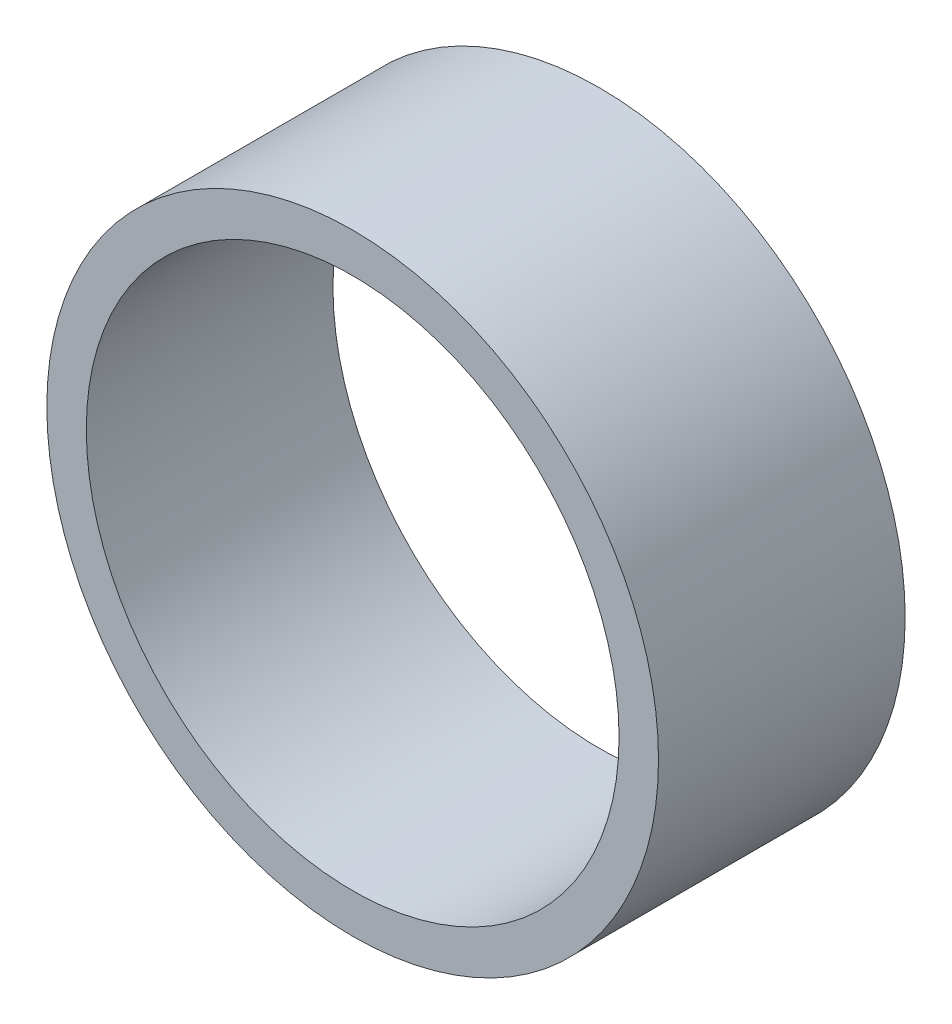
ISO-10303-21;
HEADER;
FILE_DESCRIPTION(('STEP AP214'),'2;1');
FILE_NAME('part.step','',(''),(''),'','','');
FILE_SCHEMA(('AUTOMOTIVE_DESIGN { 1 0 10303 214 1 1 1 1 }'));
ENDSEC;
DATA;
#1=APPLICATION_CONTEXT('core data for automotive mechanical design processes');
#2=APPLICATION_PROTOCOL_DEFINITION('international standard','automotive_design',2000,#1);
#3=PRODUCT_CONTEXT('',#1,'mechanical');
#4=PRODUCT('Part','Part','',(#3));
#5=PRODUCT_RELATED_PRODUCT_CATEGORY('part','',(#4));
#6=PRODUCT_DEFINITION_FORMATION('','',#4);
#7=PRODUCT_DEFINITION_CONTEXT('part definition',#1,'design');
#8=PRODUCT_DEFINITION('design','',#6,#7);
#9=PRODUCT_DEFINITION_SHAPE('','',#8);
#10=(LENGTH_UNIT() NAMED_UNIT(*) SI_UNIT(.MILLI.,.METRE.));
#11=(NAMED_UNIT(*) PLANE_ANGLE_UNIT() SI_UNIT($,.RADIAN.));
#12=(NAMED_UNIT(*) SI_UNIT($,.STERADIAN.) SOLID_ANGLE_UNIT());
#13=UNCERTAINTY_MEASURE_WITH_UNIT(LENGTH_MEASURE(1.E-05),#10,'distance_accuracy_value','');
#14=(GEOMETRIC_REPRESENTATION_CONTEXT(3) GLOBAL_UNCERTAINTY_ASSIGNED_CONTEXT((#13)) GLOBAL_UNIT_ASSIGNED_CONTEXT((#10,
#11,#12)) REPRESENTATION_CONTEXT('',''));
#15=CARTESIAN_POINT('',(0.,0.,0.));
#16=DIRECTION('',(0.,0.,1.));
#17=DIRECTION('',(1.,0.,0.));
#18=AXIS2_PLACEMENT_3D('',#15,#16,#17);
#19=CARTESIAN_POINT('',(0.,0.,25.));
#20=DIRECTION('',(0.,0.,1.));
#21=DIRECTION('',(1.,0.,0.));
#22=AXIS2_PLACEMENT_3D('',#19,#20,#21);
#23=PLANE('',#22);
#24=CARTESIAN_POINT('',(0.,0.,25.));
#25=DIRECTION('',(0.,0.,1.));
#26=DIRECTION('',(1.,0.,0.));
#27=AXIS2_PLACEMENT_3D('',#24,#25,#26);
#28=CIRCLE('',#27,31.);
#29=CARTESIAN_POINT('',(31.,0.,25.));
#30=VERTEX_POINT('',#29);
#31=EDGE_CURVE('E10',#30,#30,#28,.T.);
#32=ORIENTED_EDGE('',*,*,#31,.T.);
#33=EDGE_LOOP('',(#32));
#34=FACE_BOUND('',#33,.T.);
#35=CARTESIAN_POINT('',(0.,0.,25.));
#36=DIRECTION('',(0.,0.,1.));
#37=DIRECTION('',(1.,0.,0.));
#38=AXIS2_PLACEMENT_3D('',#35,#36,#37);
#39=CIRCLE('',#38,27.);
#40=CARTESIAN_POINT('',(27.,0.,25.));
#41=VERTEX_POINT('',#40);
#42=EDGE_CURVE('E41',#41,#41,#39,.T.);
#43=ORIENTED_EDGE('',*,*,#42,.F.);
#44=EDGE_LOOP('',(#43));
#45=FACE_BOUND('',#44,.T.);
#46=ADVANCED_FACE('F30',(#34,#45),#23,.T.);
#47=CARTESIAN_POINT('',(0.,0.,0.));
#48=DIRECTION('',(0.,0.,1.));
#49=DIRECTION('',(1.,0.,0.));
#50=AXIS2_PLACEMENT_3D('',#47,#48,#49);
#51=PLANE('',#50);
#52=CARTESIAN_POINT('',(0.,0.,0.));
#53=DIRECTION('',(0.,0.,1.));
#54=DIRECTION('',(1.,0.,0.));
#55=AXIS2_PLACEMENT_3D('',#52,#53,#54);
#56=CIRCLE('',#55,31.);
#57=CARTESIAN_POINT('',(31.,0.,0.));
#58=VERTEX_POINT('',#57);
#59=EDGE_CURVE('E34',#58,#58,#56,.T.);
#60=ORIENTED_EDGE('',*,*,#59,.F.);
#61=EDGE_LOOP('',(#60));
#62=FACE_BOUND('',#61,.T.);
#63=CARTESIAN_POINT('',(0.,0.,0.));
#64=DIRECTION('',(0.,0.,1.));
#65=DIRECTION('',(1.,0.,0.));
#66=AXIS2_PLACEMENT_3D('',#63,#64,#65);
#67=CIRCLE('',#66,27.);
#68=CARTESIAN_POINT('',(27.,0.,0.));
#69=VERTEX_POINT('',#68);
#70=EDGE_CURVE('E43',#69,#69,#67,.T.);
#71=ORIENTED_EDGE('',*,*,#70,.T.);
#72=EDGE_LOOP('',(#71));
#73=FACE_BOUND('',#72,.T.);
#74=ADVANCED_FACE('F53',(#62,#73),#51,.F.);
#75=CARTESIAN_POINT('',(0.,0.,25.));
#76=DIRECTION('',(0.,0.,-1.));
#77=DIRECTION('',(-1.,0.,0.));
#78=AXIS2_PLACEMENT_3D('',#75,#76,#77);
#79=CYLINDRICAL_SURFACE('',#78,31.);
#80=ORIENTED_EDGE('',*,*,#31,.F.);
#81=EDGE_LOOP('',(#80));
#82=FACE_BOUND('',#81,.T.);
#83=ORIENTED_EDGE('',*,*,#59,.T.);
#84=EDGE_LOOP('',(#83));
#85=FACE_BOUND('',#84,.T.);
#86=ADVANCED_FACE('F32',(#82,#85),#79,.T.);
#87=CARTESIAN_POINT('',(0.,0.,25.));
#88=DIRECTION('',(0.,0.,-1.));
#89=DIRECTION('',(-1.,0.,0.));
#90=AXIS2_PLACEMENT_3D('',#87,#88,#89);
#91=CYLINDRICAL_SURFACE('',#90,27.);
#92=ORIENTED_EDGE('',*,*,#42,.T.);
#93=EDGE_LOOP('',(#92));
#94=FACE_BOUND('',#93,.T.);
#95=ORIENTED_EDGE('',*,*,#70,.F.);
#96=EDGE_LOOP('',(#95));
#97=FACE_BOUND('',#96,.T.);
#98=ADVANCED_FACE('F49',(#94,#97),#91,.F.);
#99=CLOSED_SHELL('',(#46,#74,#86,#98));
#100=MANIFOLD_SOLID_BREP('B2',#99);
#101=ADVANCED_BREP_SHAPE_REPRESENTATION('',(#18,#100),#14);
#102=SHAPE_DEFINITION_REPRESENTATION(#9,#101);
ENDSEC;
END-ISO-10303-21;
